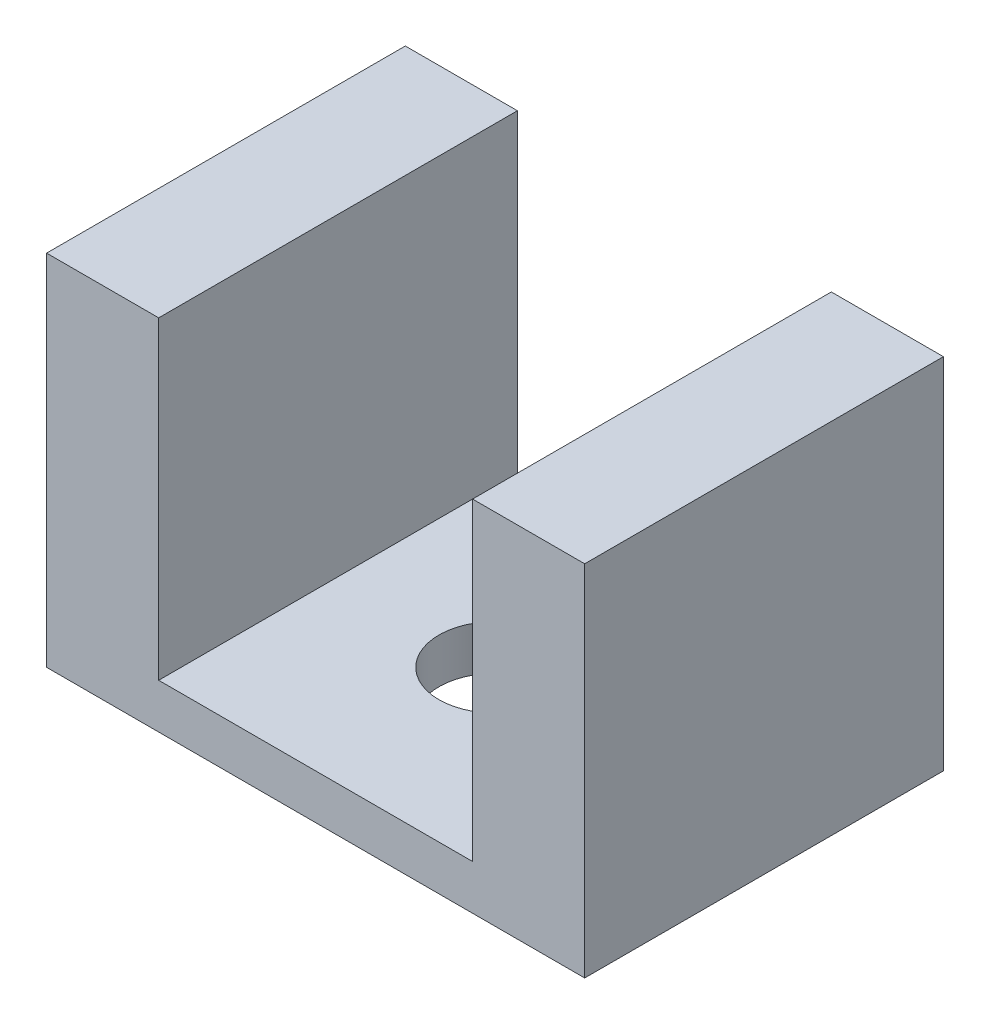
ISO-10303-21;
HEADER;
FILE_DESCRIPTION(('STEP AP214'),'2;1');
FILE_NAME('part.step','',(''),(''),'','','');
FILE_SCHEMA(('AUTOMOTIVE_DESIGN { 1 0 10303 214 1 1 1 1 }'));
ENDSEC;
DATA;
#1=APPLICATION_CONTEXT('core data for automotive mechanical design processes');
#2=APPLICATION_PROTOCOL_DEFINITION('international standard','automotive_design',2000,#1);
#3=PRODUCT_CONTEXT('',#1,'mechanical');
#4=PRODUCT('Part','Part','',(#3));
#5=PRODUCT_RELATED_PRODUCT_CATEGORY('part','',(#4));
#6=PRODUCT_DEFINITION_FORMATION('','',#4);
#7=PRODUCT_DEFINITION_CONTEXT('part definition',#1,'design');
#8=PRODUCT_DEFINITION('design','',#6,#7);
#9=PRODUCT_DEFINITION_SHAPE('','',#8);
#10=(LENGTH_UNIT() NAMED_UNIT(*) SI_UNIT(.MILLI.,.METRE.));
#11=(NAMED_UNIT(*) PLANE_ANGLE_UNIT() SI_UNIT($,.RADIAN.));
#12=(NAMED_UNIT(*) SI_UNIT($,.STERADIAN.) SOLID_ANGLE_UNIT());
#13=UNCERTAINTY_MEASURE_WITH_UNIT(LENGTH_MEASURE(1.E-05),#10,'distance_accuracy_value','');
#14=(GEOMETRIC_REPRESENTATION_CONTEXT(3) GLOBAL_UNCERTAINTY_ASSIGNED_CONTEXT((#13)) GLOBAL_UNIT_ASSIGNED_CONTEXT((#10,
#11,#12)) REPRESENTATION_CONTEXT('',''));
#15=CARTESIAN_POINT('',(0.,0.,0.));
#16=DIRECTION('',(0.,0.,1.));
#17=DIRECTION('',(1.,0.,0.));
#18=AXIS2_PLACEMENT_3D('',#15,#16,#17);
#19=CARTESIAN_POINT('',(38.1,44.45,50.8));
#20=DIRECTION('',(-1.,0.,0.));
#21=DIRECTION('',(0.,-1.,0.));
#22=AXIS2_PLACEMENT_3D('',#19,#20,#21);
#23=PLANE('',#22);
#24=DIRECTION('',(0.,1.,0.));
#25=VECTOR('',#24,1.);
#26=CARTESIAN_POINT('',(38.1,44.45,0.));
#27=LINE('',#26,#25);
#28=CARTESIAN_POINT('',(38.1,-6.35,0.));
#29=VERTEX_POINT('',#28);
#30=CARTESIAN_POINT('',(38.1,44.45,0.));
#31=VERTEX_POINT('',#30);
#32=EDGE_CURVE('E128',#29,#31,#27,.T.);
#33=ORIENTED_EDGE('',*,*,#32,.T.);
#34=DIRECTION('',(0.,0.,-1.));
#35=VECTOR('',#34,1.);
#36=CARTESIAN_POINT('',(38.1,44.45,50.8));
#37=LINE('',#36,#35);
#38=CARTESIAN_POINT('',(38.1,44.45,50.8));
#39=VERTEX_POINT('',#38);
#40=EDGE_CURVE('E11',#39,#31,#37,.T.);
#41=ORIENTED_EDGE('',*,*,#40,.F.);
#42=DIRECTION('',(0.,1.,0.));
#43=VECTOR('',#42,1.);
#44=CARTESIAN_POINT('',(38.1,44.45,50.8));
#45=LINE('',#44,#43);
#46=CARTESIAN_POINT('',(38.1,-6.35,50.8));
#47=VERTEX_POINT('',#46);
#48=EDGE_CURVE('E143',#47,#39,#45,.T.);
#49=ORIENTED_EDGE('',*,*,#48,.F.);
#50=DIRECTION('',(0.,0.,-1.));
#51=VECTOR('',#50,1.);
#52=CARTESIAN_POINT('',(38.1,-6.35,50.8));
#53=LINE('',#52,#51);
#54=EDGE_CURVE('E124',#47,#29,#53,.T.);
#55=ORIENTED_EDGE('',*,*,#54,.T.);
#56=EDGE_LOOP('',(#33,#41,#49,#55));
#57=FACE_BOUND('',#56,.T.);
#58=ADVANCED_FACE('F32',(#57),#23,.F.);
#59=CARTESIAN_POINT('',(22.225,44.45,50.8));
#60=DIRECTION('',(0.,-1.,0.));
#61=DIRECTION('',(0.,0.,-1.));
#62=AXIS2_PLACEMENT_3D('',#59,#60,#61);
#63=PLANE('',#62);
#64=DIRECTION('',(-1.,0.,0.));
#65=VECTOR('',#64,1.);
#66=CARTESIAN_POINT('',(22.225,44.45,0.));
#67=LINE('',#66,#65);
#68=CARTESIAN_POINT('',(22.225,44.45,0.));
#69=VERTEX_POINT('',#68);
#70=EDGE_CURVE('E131',#31,#69,#67,.T.);
#71=ORIENTED_EDGE('',*,*,#70,.T.);
#72=DIRECTION('',(0.,0.,-1.));
#73=VECTOR('',#72,1.);
#74=CARTESIAN_POINT('',(22.225,44.45,50.8));
#75=LINE('',#74,#73);
#76=CARTESIAN_POINT('',(22.225,44.45,50.8));
#77=VERTEX_POINT('',#76);
#78=EDGE_CURVE('E40',#77,#69,#75,.T.);
#79=ORIENTED_EDGE('',*,*,#78,.F.);
#80=DIRECTION('',(-1.,0.,0.));
#81=VECTOR('',#80,1.);
#82=CARTESIAN_POINT('',(22.225,44.45,50.8));
#83=LINE('',#82,#81);
#84=EDGE_CURVE('E91',#39,#77,#83,.T.);
#85=ORIENTED_EDGE('',*,*,#84,.F.);
#86=ORIENTED_EDGE('',*,*,#40,.T.);
#87=EDGE_LOOP('',(#71,#79,#85,#86));
#88=FACE_BOUND('',#87,.T.);
#89=ADVANCED_FACE('F197',(#88),#63,.F.);
#90=CARTESIAN_POINT('',(22.225,0.,50.8));
#91=DIRECTION('',(1.,0.,0.));
#92=DIRECTION('',(0.,0.,-1.));
#93=AXIS2_PLACEMENT_3D('',#90,#91,#92);
#94=PLANE('',#93);
#95=DIRECTION('',(0.,-1.,0.));
#96=VECTOR('',#95,1.);
#97=CARTESIAN_POINT('',(22.225,0.,0.));
#98=LINE('',#97,#96);
#99=CARTESIAN_POINT('',(22.225,0.,0.));
#100=VERTEX_POINT('',#99);
#101=EDGE_CURVE('E134',#69,#100,#98,.T.);
#102=ORIENTED_EDGE('',*,*,#101,.T.);
#103=DIRECTION('',(0.,0.,-1.));
#104=VECTOR('',#103,1.);
#105=CARTESIAN_POINT('',(22.225,0.,50.8));
#106=LINE('',#105,#104);
#107=CARTESIAN_POINT('',(22.225,0.,50.8));
#108=VERTEX_POINT('',#107);
#109=EDGE_CURVE('E150',#108,#100,#106,.T.);
#110=ORIENTED_EDGE('',*,*,#109,.F.);
#111=DIRECTION('',(0.,-1.,0.));
#112=VECTOR('',#111,1.);
#113=CARTESIAN_POINT('',(22.225,0.,50.8));
#114=LINE('',#113,#112);
#115=EDGE_CURVE('E158',#77,#108,#114,.T.);
#116=ORIENTED_EDGE('',*,*,#115,.F.);
#117=ORIENTED_EDGE('',*,*,#78,.T.);
#118=EDGE_LOOP('',(#102,#110,#116,#117));
#119=FACE_BOUND('',#118,.T.);
#120=ADVANCED_FACE('F156',(#119),#94,.F.);
#121=CARTESIAN_POINT('',(22.225,0.,50.8));
#122=DIRECTION('',(0.,-1.,0.));
#123=DIRECTION('',(0.,0.,-1.));
#124=AXIS2_PLACEMENT_3D('',#121,#122,#123);
#125=PLANE('',#124);
#126=CARTESIAN_POINT('',(0.,0.,25.4));
#127=DIRECTION('',(0.,1.,0.));
#128=DIRECTION('',(0.,0.,1.));
#129=AXIS2_PLACEMENT_3D('',#126,#127,#128);
#130=CIRCLE('',#129,7.9375);
#131=CARTESIAN_POINT('',(0.,0.,33.3375));
#132=VERTEX_POINT('',#131);
#133=EDGE_CURVE('E176',#132,#132,#130,.T.);
#134=ORIENTED_EDGE('',*,*,#133,.F.);
#135=EDGE_LOOP('',(#134));
#136=FACE_BOUND('',#135,.T.);
#137=DIRECTION('',(-1.,0.,0.));
#138=VECTOR('',#137,1.);
#139=CARTESIAN_POINT('',(22.225,0.,0.));
#140=LINE('',#139,#138);
#141=CARTESIAN_POINT('',(-22.225,0.,0.));
#142=VERTEX_POINT('',#141);
#143=EDGE_CURVE('E136',#100,#142,#140,.T.);
#144=ORIENTED_EDGE('',*,*,#143,.T.);
#145=DIRECTION('',(0.,0.,-1.));
#146=VECTOR('',#145,1.);
#147=CARTESIAN_POINT('',(-22.225,0.,50.8));
#148=LINE('',#147,#146);
#149=CARTESIAN_POINT('',(-22.225,0.,50.8));
#150=VERTEX_POINT('',#149);
#151=EDGE_CURVE('E147',#150,#142,#148,.T.);
#152=ORIENTED_EDGE('',*,*,#151,.F.);
#153=DIRECTION('',(-1.,0.,0.));
#154=VECTOR('',#153,1.);
#155=CARTESIAN_POINT('',(22.225,0.,50.8));
#156=LINE('',#155,#154);
#157=EDGE_CURVE('E170',#108,#150,#156,.T.);
#158=ORIENTED_EDGE('',*,*,#157,.F.);
#159=ORIENTED_EDGE('',*,*,#109,.T.);
#160=EDGE_LOOP('',(#144,#152,#158,#159));
#161=FACE_BOUND('',#160,.T.);
#162=ADVANCED_FACE('F166',(#136,#161),#125,.F.);
#163=CARTESIAN_POINT('',(-22.225,0.,50.8));
#164=DIRECTION('',(-1.,0.,0.));
#165=DIRECTION('',(0.,0.,1.));
#166=AXIS2_PLACEMENT_3D('',#163,#164,#165);
#167=PLANE('',#166);
#168=DIRECTION('',(0.,1.,0.));
#169=VECTOR('',#168,1.);
#170=CARTESIAN_POINT('',(-22.225,0.,0.));
#171=LINE('',#170,#169);
#172=CARTESIAN_POINT('',(-22.225,44.45,0.));
#173=VERTEX_POINT('',#172);
#174=EDGE_CURVE('E138',#142,#173,#171,.T.);
#175=ORIENTED_EDGE('',*,*,#174,.T.);
#176=DIRECTION('',(0.,0.,-1.));
#177=VECTOR('',#176,1.);
#178=CARTESIAN_POINT('',(-22.225,44.45,50.8));
#179=LINE('',#178,#177);
#180=CARTESIAN_POINT('',(-22.225,44.45,50.8));
#181=VERTEX_POINT('',#180);
#182=EDGE_CURVE('E119',#181,#173,#179,.T.);
#183=ORIENTED_EDGE('',*,*,#182,.F.);
#184=DIRECTION('',(0.,1.,0.));
#185=VECTOR('',#184,1.);
#186=CARTESIAN_POINT('',(-22.225,0.,50.8));
#187=LINE('',#186,#185);
#188=EDGE_CURVE('E110',#150,#181,#187,.T.);
#189=ORIENTED_EDGE('',*,*,#188,.F.);
#190=ORIENTED_EDGE('',*,*,#151,.T.);
#191=EDGE_LOOP('',(#175,#183,#189,#190));
#192=FACE_BOUND('',#191,.T.);
#193=ADVANCED_FACE('F169',(#192),#167,.F.);
#194=CARTESIAN_POINT('',(-22.225,44.45,50.8));
#195=DIRECTION('',(0.,-1.,0.));
#196=DIRECTION('',(0.,0.,-1.));
#197=AXIS2_PLACEMENT_3D('',#194,#195,#196);
#198=PLANE('',#197);
#199=DIRECTION('',(-1.,0.,0.));
#200=VECTOR('',#199,1.);
#201=CARTESIAN_POINT('',(-22.225,44.45,0.));
#202=LINE('',#201,#200);
#203=CARTESIAN_POINT('',(-38.1,44.45,0.));
#204=VERTEX_POINT('',#203);
#205=EDGE_CURVE('E118',#173,#204,#202,.T.);
#206=ORIENTED_EDGE('',*,*,#205,.T.);
#207=DIRECTION('',(0.,0.,-1.));
#208=VECTOR('',#207,1.);
#209=CARTESIAN_POINT('',(-38.1,44.45,50.8));
#210=LINE('',#209,#208);
#211=CARTESIAN_POINT('',(-38.1,44.45,50.8));
#212=VERTEX_POINT('',#211);
#213=EDGE_CURVE('E115',#212,#204,#210,.T.);
#214=ORIENTED_EDGE('',*,*,#213,.F.);
#215=DIRECTION('',(-1.,0.,0.));
#216=VECTOR('',#215,1.);
#217=CARTESIAN_POINT('',(-22.225,44.45,50.8));
#218=LINE('',#217,#216);
#219=EDGE_CURVE('E104',#181,#212,#218,.T.);
#220=ORIENTED_EDGE('',*,*,#219,.F.);
#221=ORIENTED_EDGE('',*,*,#182,.T.);
#222=EDGE_LOOP('',(#206,#214,#220,#221));
#223=FACE_BOUND('',#222,.T.);
#224=ADVANCED_FACE('F116',(#223),#198,.F.);
#225=CARTESIAN_POINT('',(-38.1,44.45,50.8));
#226=DIRECTION('',(1.,0.,0.));
#227=DIRECTION('',(0.,1.,0.));
#228=AXIS2_PLACEMENT_3D('',#225,#226,#227);
#229=PLANE('',#228);
#230=DIRECTION('',(0.,-1.,0.));
#231=VECTOR('',#230,1.);
#232=CARTESIAN_POINT('',(-38.1,44.45,0.));
#233=LINE('',#232,#231);
#234=CARTESIAN_POINT('',(-38.1,-6.35,0.));
#235=VERTEX_POINT('',#234);
#236=EDGE_CURVE('E77',#204,#235,#233,.T.);
#237=ORIENTED_EDGE('',*,*,#236,.T.);
#238=DIRECTION('',(0.,0.,-1.));
#239=VECTOR('',#238,1.);
#240=CARTESIAN_POINT('',(-38.1,-6.35,50.8));
#241=LINE('',#240,#239);
#242=CARTESIAN_POINT('',(-38.1,-6.35,50.8));
#243=VERTEX_POINT('',#242);
#244=EDGE_CURVE('E120',#243,#235,#241,.T.);
#245=ORIENTED_EDGE('',*,*,#244,.F.);
#246=DIRECTION('',(0.,-1.,0.));
#247=VECTOR('',#246,1.);
#248=CARTESIAN_POINT('',(-38.1,44.45,50.8));
#249=LINE('',#248,#247);
#250=EDGE_CURVE('E108',#212,#243,#249,.T.);
#251=ORIENTED_EDGE('',*,*,#250,.F.);
#252=ORIENTED_EDGE('',*,*,#213,.T.);
#253=EDGE_LOOP('',(#237,#245,#251,#252));
#254=FACE_BOUND('',#253,.T.);
#255=ADVANCED_FACE('F122',(#254),#229,.F.);
#256=CARTESIAN_POINT('',(-38.1,-6.35,50.8));
#257=DIRECTION('',(0.,1.,0.));
#258=DIRECTION('',(0.,0.,1.));
#259=AXIS2_PLACEMENT_3D('',#256,#257,#258);
#260=PLANE('',#259);
#261=CARTESIAN_POINT('',(0.,-6.35,25.4));
#262=DIRECTION('',(0.,1.,0.));
#263=DIRECTION('',(0.,0.,1.));
#264=AXIS2_PLACEMENT_3D('',#261,#262,#263);
#265=CIRCLE('',#264,7.9375);
#266=CARTESIAN_POINT('',(0.,-6.35,33.3375));
#267=VERTEX_POINT('',#266);
#268=EDGE_CURVE('E132',#267,#267,#265,.T.);
#269=ORIENTED_EDGE('',*,*,#268,.T.);
#270=EDGE_LOOP('',(#269));
#271=FACE_BOUND('',#270,.T.);
#272=DIRECTION('',(1.,0.,0.));
#273=VECTOR('',#272,1.);
#274=CARTESIAN_POINT('',(-38.1,-6.35,0.));
#275=LINE('',#274,#273);
#276=EDGE_CURVE('E83',#235,#29,#275,.T.);
#277=ORIENTED_EDGE('',*,*,#276,.T.);
#278=ORIENTED_EDGE('',*,*,#54,.F.);
#279=DIRECTION('',(1.,0.,0.));
#280=VECTOR('',#279,1.);
#281=CARTESIAN_POINT('',(-38.1,-6.35,50.8));
#282=LINE('',#281,#280);
#283=EDGE_CURVE('E48',#243,#47,#282,.T.);
#284=ORIENTED_EDGE('',*,*,#283,.F.);
#285=ORIENTED_EDGE('',*,*,#244,.T.);
#286=EDGE_LOOP('',(#277,#278,#284,#285));
#287=FACE_BOUND('',#286,.T.);
#288=ADVANCED_FACE('F182',(#271,#287),#260,.F.);
#289=CARTESIAN_POINT('',(0.,0.,50.8));
#290=DIRECTION('',(0.,0.,1.));
#291=DIRECTION('',(1.,0.,0.));
#292=AXIS2_PLACEMENT_3D('',#289,#290,#291);
#293=PLANE('',#292);
#294=ORIENTED_EDGE('',*,*,#48,.T.);
#295=ORIENTED_EDGE('',*,*,#84,.T.);
#296=ORIENTED_EDGE('',*,*,#115,.T.);
#297=ORIENTED_EDGE('',*,*,#157,.T.);
#298=ORIENTED_EDGE('',*,*,#188,.T.);
#299=ORIENTED_EDGE('',*,*,#219,.T.);
#300=ORIENTED_EDGE('',*,*,#250,.T.);
#301=ORIENTED_EDGE('',*,*,#283,.T.);
#302=EDGE_LOOP('',(#294,#295,#296,#297,#298,#299,#300,#301));
#303=FACE_BOUND('',#302,.T.);
#304=ADVANCED_FACE('F106',(#303),#293,.T.);
#305=CARTESIAN_POINT('',(0.,0.,0.));
#306=DIRECTION('',(0.,0.,1.));
#307=DIRECTION('',(1.,0.,0.));
#308=AXIS2_PLACEMENT_3D('',#305,#306,#307);
#309=PLANE('',#308);
#310=ORIENTED_EDGE('',*,*,#32,.F.);
#311=ORIENTED_EDGE('',*,*,#276,.F.);
#312=ORIENTED_EDGE('',*,*,#236,.F.);
#313=ORIENTED_EDGE('',*,*,#205,.F.);
#314=ORIENTED_EDGE('',*,*,#174,.F.);
#315=ORIENTED_EDGE('',*,*,#143,.F.);
#316=ORIENTED_EDGE('',*,*,#101,.F.);
#317=ORIENTED_EDGE('',*,*,#70,.F.);
#318=EDGE_LOOP('',(#310,#311,#312,#313,#314,#315,#316,#317));
#319=FACE_BOUND('',#318,.T.);
#320=ADVANCED_FACE('F162',(#319),#309,.F.);
#321=CARTESIAN_POINT('',(0.,-6.35,25.4));
#322=DIRECTION('',(0.,1.,0.));
#323=DIRECTION('',(0.,0.,1.));
#324=AXIS2_PLACEMENT_3D('',#321,#322,#323);
#325=CYLINDRICAL_SURFACE('',#324,7.9375);
#326=ORIENTED_EDGE('',*,*,#268,.F.);
#327=EDGE_LOOP('',(#326));
#328=FACE_BOUND('',#327,.T.);
#329=ORIENTED_EDGE('',*,*,#133,.T.);
#330=EDGE_LOOP('',(#329));
#331=FACE_BOUND('',#330,.T.);
#332=ADVANCED_FACE('F184',(#328,#331),#325,.F.);
#333=CLOSED_SHELL('',(#58,#89,#120,#162,#193,#224,#255,#288,#304,#320,#332));
#334=MANIFOLD_SOLID_BREP('B2',#333);
#335=ADVANCED_BREP_SHAPE_REPRESENTATION('',(#18,#334),#14);
#336=SHAPE_DEFINITION_REPRESENTATION(#9,#335);
ENDSEC;
END-ISO-10303-21;
